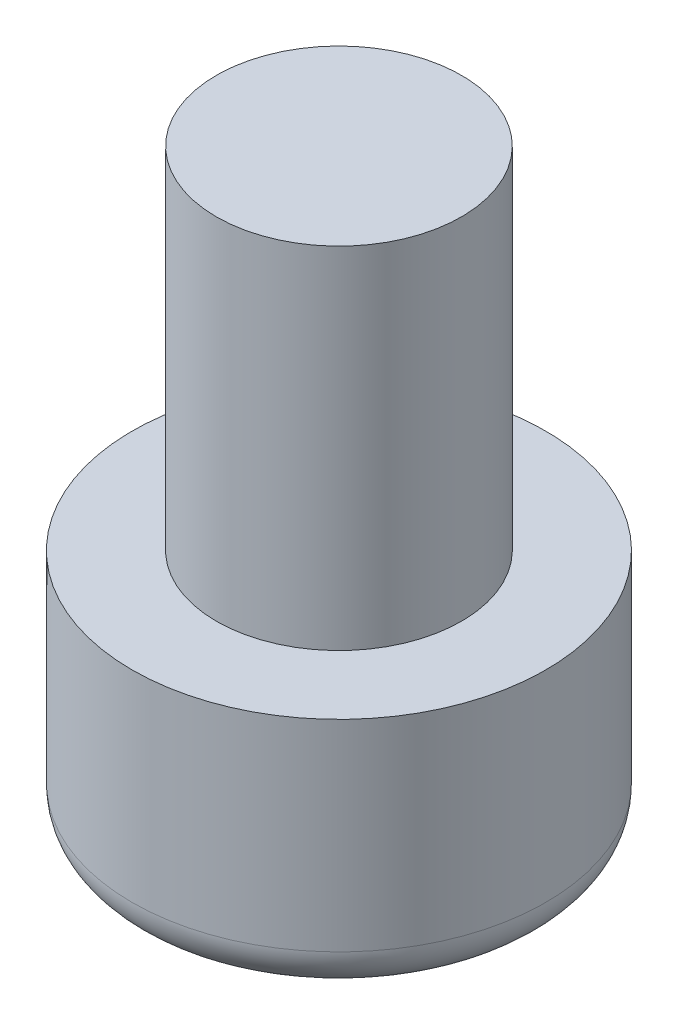
ISO-10303-21;
HEADER;
FILE_DESCRIPTION(('STEP AP214'),'2;1');
FILE_NAME('part.step','',(''),(''),'','','');
FILE_SCHEMA(('AUTOMOTIVE_DESIGN { 1 0 10303 214 1 1 1 1 }'));
ENDSEC;
DATA;
#1=APPLICATION_CONTEXT('core data for automotive mechanical design processes');
#2=APPLICATION_PROTOCOL_DEFINITION('international standard','automotive_design',2000,#1);
#3=PRODUCT_CONTEXT('',#1,'mechanical');
#4=PRODUCT('Part','Part','',(#3));
#5=PRODUCT_RELATED_PRODUCT_CATEGORY('part','',(#4));
#6=PRODUCT_DEFINITION_FORMATION('','',#4);
#7=PRODUCT_DEFINITION_CONTEXT('part definition',#1,'design');
#8=PRODUCT_DEFINITION('design','',#6,#7);
#9=PRODUCT_DEFINITION_SHAPE('','',#8);
#10=(LENGTH_UNIT() NAMED_UNIT(*) SI_UNIT(.MILLI.,.METRE.));
#11=(NAMED_UNIT(*) PLANE_ANGLE_UNIT() SI_UNIT($,.RADIAN.));
#12=(NAMED_UNIT(*) SI_UNIT($,.STERADIAN.) SOLID_ANGLE_UNIT());
#13=UNCERTAINTY_MEASURE_WITH_UNIT(LENGTH_MEASURE(1.E-05),#10,'distance_accuracy_value','');
#14=(GEOMETRIC_REPRESENTATION_CONTEXT(3) GLOBAL_UNCERTAINTY_ASSIGNED_CONTEXT((#13)) GLOBAL_UNIT_ASSIGNED_CONTEXT((#10,
#11,#12)) REPRESENTATION_CONTEXT('',''));
#15=CARTESIAN_POINT('',(0.,0.,0.));
#16=DIRECTION('',(0.,0.,1.));
#17=DIRECTION('',(1.,0.,0.));
#18=AXIS2_PLACEMENT_3D('',#15,#16,#17);
#19=CARTESIAN_POINT('',(0.,5.6,0.));
#20=DIRECTION('',(0.,1.,0.));
#21=DIRECTION('',(0.,0.,1.));
#22=AXIS2_PLACEMENT_3D('',#19,#20,#21);
#23=PLANE('',#22);
#24=CARTESIAN_POINT('',(0.,5.6,0.));
#25=DIRECTION('',(0.,1.,0.));
#26=DIRECTION('',(0.,0.,1.));
#27=AXIS2_PLACEMENT_3D('',#24,#25,#26);
#28=CIRCLE('',#27,4.725);
#29=CARTESIAN_POINT('',(0.,5.6,4.725));
#30=VERTEX_POINT('',#29);
#31=EDGE_CURVE('E42',#30,#30,#28,.T.);
#32=ORIENTED_EDGE('',*,*,#31,.T.);
#33=EDGE_LOOP('',(#32));
#34=FACE_BOUND('',#33,.T.);
#35=CARTESIAN_POINT('',(0.,5.6,0.));
#36=DIRECTION('',(0.,1.,0.));
#37=DIRECTION('',(0.,0.,1.));
#38=AXIS2_PLACEMENT_3D('',#35,#36,#37);
#39=CIRCLE('',#38,2.8);
#40=CARTESIAN_POINT('',(0.,5.6,2.8));
#41=VERTEX_POINT('',#40);
#42=EDGE_CURVE('E49',#41,#41,#39,.T.);
#43=ORIENTED_EDGE('',*,*,#42,.F.);
#44=EDGE_LOOP('',(#43));
#45=FACE_BOUND('',#44,.T.);
#46=ADVANCED_FACE('F31',(#34,#45),#23,.T.);
#47=CARTESIAN_POINT('',(0.,5.6,0.));
#48=DIRECTION('',(0.,-1.,0.));
#49=DIRECTION('',(0.,0.,-1.));
#50=AXIS2_PLACEMENT_3D('',#47,#48,#49);
#51=CYLINDRICAL_SURFACE('',#50,4.725);
#52=CARTESIAN_POINT('',(0.,1.,0.));
#53=DIRECTION('',(0.,1.,0.));
#54=DIRECTION('',(0.,0.,1.));
#55=AXIS2_PLACEMENT_3D('',#52,#53,#54);
#56=CIRCLE('',#55,4.725);
#57=CARTESIAN_POINT('',(0.,1.,4.725));
#58=VERTEX_POINT('',#57);
#59=EDGE_CURVE('E38',#58,#58,#56,.T.);
#60=ORIENTED_EDGE('',*,*,#59,.T.);
#61=EDGE_LOOP('',(#60));
#62=FACE_BOUND('',#61,.T.);
#63=ORIENTED_EDGE('',*,*,#31,.F.);
#64=EDGE_LOOP('',(#63));
#65=FACE_BOUND('',#64,.T.);
#66=ADVANCED_FACE('F65',(#62,#65),#51,.T.);
#67=CARTESIAN_POINT('',(0.,0.,0.));
#68=DIRECTION('',(0.,1.,0.));
#69=DIRECTION('',(0.,0.,1.));
#70=AXIS2_PLACEMENT_3D('',#67,#68,#69);
#71=PLANE('',#70);
#72=CARTESIAN_POINT('',(0.,0.,0.));
#73=DIRECTION('',(0.,1.,0.));
#74=DIRECTION('',(0.,0.,1.));
#75=AXIS2_PLACEMENT_3D('',#72,#73,#74);
#76=CIRCLE('',#75,3.725);
#77=CARTESIAN_POINT('',(0.,0.,3.725));
#78=VERTEX_POINT('',#77);
#79=EDGE_CURVE('E10',#78,#78,#76,.F.);
#80=ORIENTED_EDGE('',*,*,#79,.T.);
#81=EDGE_LOOP('',(#80));
#82=FACE_BOUND('',#81,.T.);
#83=ADVANCED_FACE('F60',(#82),#71,.F.);
#84=CARTESIAN_POINT('',(0.,13.6,0.));
#85=DIRECTION('',(0.,-1.,0.));
#86=DIRECTION('',(0.,0.,-1.));
#87=AXIS2_PLACEMENT_3D('',#84,#85,#86);
#88=CYLINDRICAL_SURFACE('',#87,2.8);
#89=CARTESIAN_POINT('',(0.,13.6,0.));
#90=DIRECTION('',(0.,1.,0.));
#91=DIRECTION('',(0.,0.,1.));
#92=AXIS2_PLACEMENT_3D('',#89,#90,#91);
#93=CIRCLE('',#92,2.8);
#94=CARTESIAN_POINT('',(0.,13.6,2.8));
#95=VERTEX_POINT('',#94);
#96=EDGE_CURVE('E46',#95,#95,#93,.T.);
#97=ORIENTED_EDGE('',*,*,#96,.F.);
#98=EDGE_LOOP('',(#97));
#99=FACE_BOUND('',#98,.T.);
#100=ORIENTED_EDGE('',*,*,#42,.T.);
#101=EDGE_LOOP('',(#100));
#102=FACE_BOUND('',#101,.T.);
#103=ADVANCED_FACE('F57',(#99,#102),#88,.T.);
#104=CARTESIAN_POINT('',(0.,13.6,0.));
#105=DIRECTION('',(0.,1.,0.));
#106=DIRECTION('',(0.,0.,1.));
#107=AXIS2_PLACEMENT_3D('',#104,#105,#106);
#108=PLANE('',#107);
#109=ORIENTED_EDGE('',*,*,#96,.T.);
#110=EDGE_LOOP('',(#109));
#111=FACE_BOUND('',#110,.T.);
#112=ADVANCED_FACE('F55',(#111),#108,.T.);
#113=CARTESIAN_POINT('',(0.,1.,0.));
#114=DIRECTION('',(0.,1.,0.));
#115=DIRECTION('',(0.,0.,1.));
#116=AXIS2_PLACEMENT_3D('',#113,#114,#115);
#117=TOROIDAL_SURFACE('',#116,3.725,1.);
#118=ORIENTED_EDGE('',*,*,#79,.F.);
#119=EDGE_LOOP('',(#118));
#120=FACE_BOUND('',#119,.T.);
#121=ORIENTED_EDGE('',*,*,#59,.F.);
#122=EDGE_LOOP('',(#121));
#123=FACE_BOUND('',#122,.T.);
#124=ADVANCED_FACE('F33',(#120,#123),#117,.T.);
#125=CLOSED_SHELL('',(#46,#66,#83,#103,#112,#124));
#126=MANIFOLD_SOLID_BREP('B2',#125);
#127=ADVANCED_BREP_SHAPE_REPRESENTATION('',(#18,#126),#14);
#128=SHAPE_DEFINITION_REPRESENTATION(#9,#127);
ENDSEC;
END-ISO-10303-21;
